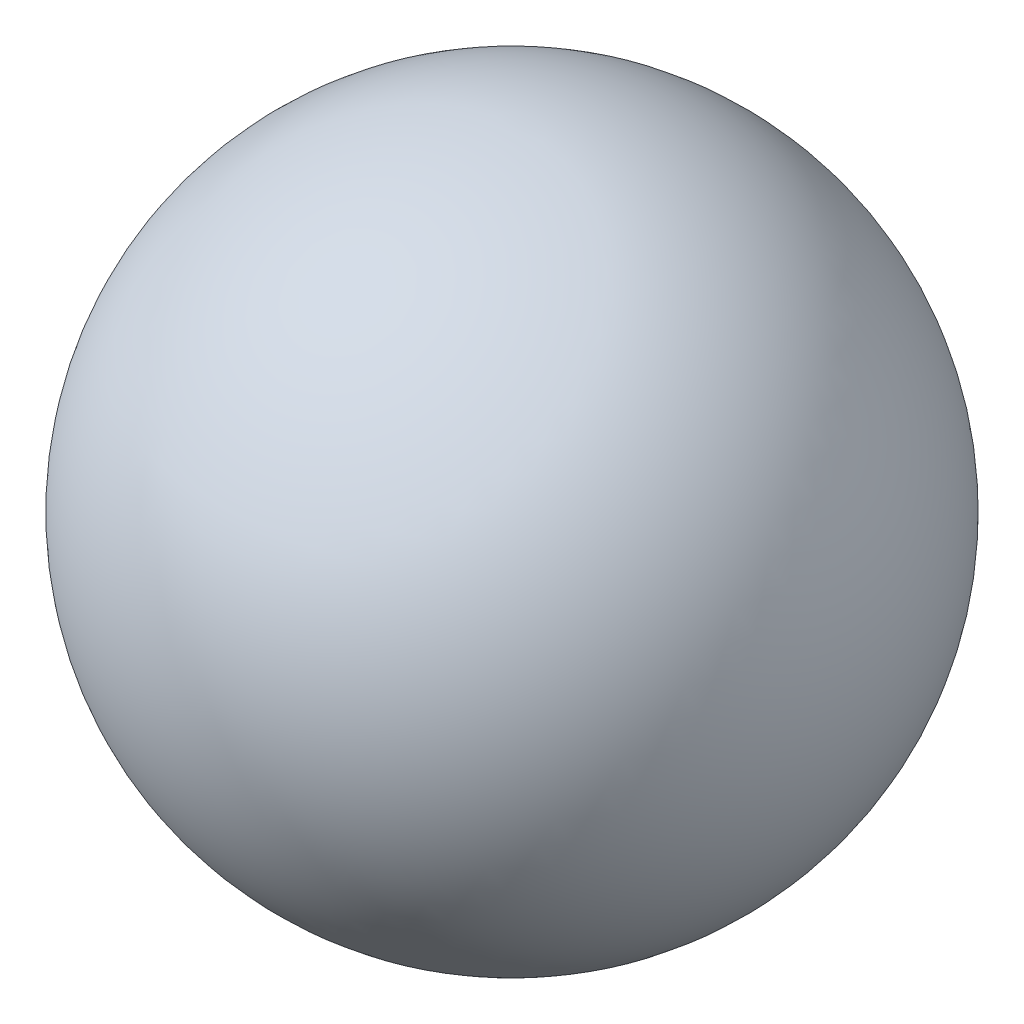
ISO-10303-21;
HEADER;
FILE_DESCRIPTION(('STEP AP214'),'2;1');
FILE_NAME('part.step','',(''),(''),'','','');
FILE_SCHEMA(('AUTOMOTIVE_DESIGN { 1 0 10303 214 1 1 1 1 }'));
ENDSEC;
DATA;
#1=APPLICATION_CONTEXT('core data for automotive mechanical design processes');
#2=APPLICATION_PROTOCOL_DEFINITION('international standard','automotive_design',2000,#1);
#3=PRODUCT_CONTEXT('',#1,'mechanical');
#4=PRODUCT('Part','Part','',(#3));
#5=PRODUCT_RELATED_PRODUCT_CATEGORY('part','',(#4));
#6=PRODUCT_DEFINITION_FORMATION('','',#4);
#7=PRODUCT_DEFINITION_CONTEXT('part definition',#1,'design');
#8=PRODUCT_DEFINITION('design','',#6,#7);
#9=PRODUCT_DEFINITION_SHAPE('','',#8);
#10=(LENGTH_UNIT() NAMED_UNIT(*) SI_UNIT(.MILLI.,.METRE.));
#11=(NAMED_UNIT(*) PLANE_ANGLE_UNIT() SI_UNIT($,.RADIAN.));
#12=(NAMED_UNIT(*) SI_UNIT($,.STERADIAN.) SOLID_ANGLE_UNIT());
#13=UNCERTAINTY_MEASURE_WITH_UNIT(LENGTH_MEASURE(1.E-05),#10,'distance_accuracy_value','');
#14=(GEOMETRIC_REPRESENTATION_CONTEXT(3) GLOBAL_UNCERTAINTY_ASSIGNED_CONTEXT((#13)) GLOBAL_UNIT_ASSIGNED_CONTEXT((#10,
#11,#12)) REPRESENTATION_CONTEXT('',''));
#15=CARTESIAN_POINT('',(0.,0.,0.));
#16=DIRECTION('',(0.,0.,1.));
#17=DIRECTION('',(1.,0.,0.));
#18=AXIS2_PLACEMENT_3D('',#15,#16,#17);
#19=CARTESIAN_POINT('',(0.,0.,0.));
#20=DIRECTION('',(0.,-1.,0.));
#21=DIRECTION('',(-1.,0.,0.));
#22=AXIS2_PLACEMENT_3D('',#19,#20,#21);
#23=SPHERICAL_SURFACE('',#22,127.);
#24=CARTESIAN_POINT('',(0.,-127.,0.));
#25=VERTEX_POINT('',#24);
#26=VERTEX_LOOP('',#25);
#27=FACE_BOUND('',#26,.T.);
#28=ADVANCED_FACE('F38',(#27),#23,.T.);
#29=CLOSED_SHELL('',(#28));
#30=MANIFOLD_SOLID_BREP('B2',#29);
#31=ADVANCED_BREP_SHAPE_REPRESENTATION('',(#18,#30),#14);
#32=SHAPE_DEFINITION_REPRESENTATION(#9,#31);
ENDSEC;
END-ISO-10303-21;
